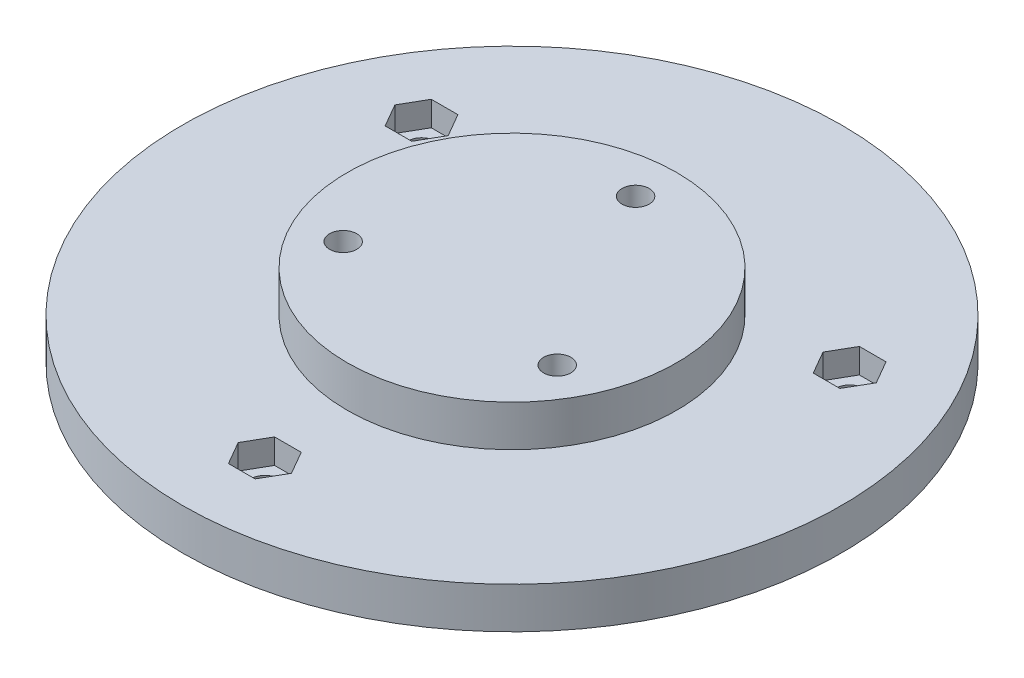
ISO-10303-21;
HEADER;
FILE_DESCRIPTION(('STEP AP214'),'2;1');
FILE_NAME('part.step','',(''),(''),'','','');
FILE_SCHEMA(('AUTOMOTIVE_DESIGN { 1 0 10303 214 1 1 1 1 }'));
ENDSEC;
DATA;
#1=APPLICATION_CONTEXT('core data for automotive mechanical design processes');
#2=APPLICATION_PROTOCOL_DEFINITION('international standard','automotive_design',2000,#1);
#3=PRODUCT_CONTEXT('',#1,'mechanical');
#4=PRODUCT('Part','Part','',(#3));
#5=PRODUCT_RELATED_PRODUCT_CATEGORY('part','',(#4));
#6=PRODUCT_DEFINITION_FORMATION('','',#4);
#7=PRODUCT_DEFINITION_CONTEXT('part definition',#1,'design');
#8=PRODUCT_DEFINITION('design','',#6,#7);
#9=PRODUCT_DEFINITION_SHAPE('','',#8);
#10=(LENGTH_UNIT() NAMED_UNIT(*) SI_UNIT(.MILLI.,.METRE.));
#11=(NAMED_UNIT(*) PLANE_ANGLE_UNIT() SI_UNIT($,.RADIAN.));
#12=(NAMED_UNIT(*) SI_UNIT($,.STERADIAN.) SOLID_ANGLE_UNIT());
#13=UNCERTAINTY_MEASURE_WITH_UNIT(LENGTH_MEASURE(1.E-05),#10,'distance_accuracy_value','');
#14=(GEOMETRIC_REPRESENTATION_CONTEXT(3) GLOBAL_UNCERTAINTY_ASSIGNED_CONTEXT((#13)) GLOBAL_UNIT_ASSIGNED_CONTEXT((#10,
#11,#12)) REPRESENTATION_CONTEXT('',''));
#15=CARTESIAN_POINT('',(0.,0.,0.));
#16=DIRECTION('',(0.,0.,1.));
#17=DIRECTION('',(1.,0.,0.));
#18=AXIS2_PLACEMENT_3D('',#15,#16,#17);
#19=CARTESIAN_POINT('',(0.,20.,-15.));
#20=DIRECTION('',(0.,-1.,0.));
#21=DIRECTION('',(0.,0.,-1.));
#22=AXIS2_PLACEMENT_3D('',#19,#20,#21);
#23=CYLINDRICAL_SURFACE('',#22,1.65);
#24=CARTESIAN_POINT('',(0.,5.,-15.));
#25=DIRECTION('',(0.,1.,0.));
#26=DIRECTION('',(0.,0.,1.));
#27=AXIS2_PLACEMENT_3D('',#24,#25,#26);
#28=CIRCLE('',#27,1.65);
#29=CARTESIAN_POINT('',(0.,5.,-13.35));
#30=VERTEX_POINT('',#29);
#31=EDGE_CURVE('E11',#30,#30,#28,.T.);
#32=ORIENTED_EDGE('',*,*,#31,.T.);
#33=EDGE_LOOP('',(#32));
#34=FACE_BOUND('',#33,.T.);
#35=CARTESIAN_POINT('',(0.,-2.,-15.));
#36=DIRECTION('',(0.,-1.,0.));
#37=DIRECTION('',(0.,0.,-1.));
#38=AXIS2_PLACEMENT_3D('',#35,#36,#37);
#39=CIRCLE('',#38,1.65);
#40=CARTESIAN_POINT('',(0.,-2.,-16.65));
#41=VERTEX_POINT('',#40);
#42=EDGE_CURVE('E24',#41,#41,#39,.T.);
#43=ORIENTED_EDGE('',*,*,#42,.T.);
#44=EDGE_LOOP('',(#43));
#45=FACE_BOUND('',#44,.T.);
#46=ADVANCED_FACE('F17',(#34,#45),#23,.F.);
#47=CARTESIAN_POINT('',(-12.9903810567666,20.,7.5));
#48=DIRECTION('',(0.,-1.,0.));
#49=DIRECTION('',(0.,0.,-1.));
#50=AXIS2_PLACEMENT_3D('',#47,#48,#49);
#51=CYLINDRICAL_SURFACE('',#50,1.65);
#52=CARTESIAN_POINT('',(-12.9903810567666,5.,7.5));
#53=DIRECTION('',(0.,1.,0.));
#54=DIRECTION('',(0.,0.,1.));
#55=AXIS2_PLACEMENT_3D('',#52,#53,#54);
#56=CIRCLE('',#55,1.65);
#57=CARTESIAN_POINT('',(-12.9903810567666,5.,9.15));
#58=VERTEX_POINT('',#57);
#59=EDGE_CURVE('E351',#58,#58,#56,.T.);
#60=ORIENTED_EDGE('',*,*,#59,.T.);
#61=EDGE_LOOP('',(#60));
#62=FACE_BOUND('',#61,.T.);
#63=CARTESIAN_POINT('',(-12.9903810567666,-2.,7.5));
#64=DIRECTION('',(0.,-1.,0.));
#65=DIRECTION('',(0.,0.,-1.));
#66=AXIS2_PLACEMENT_3D('',#63,#64,#65);
#67=CIRCLE('',#66,1.65);
#68=CARTESIAN_POINT('',(-12.9903810567666,-2.,5.85));
#69=VERTEX_POINT('',#68);
#70=EDGE_CURVE('E348',#69,#69,#67,.T.);
#71=ORIENTED_EDGE('',*,*,#70,.T.);
#72=EDGE_LOOP('',(#71));
#73=FACE_BOUND('',#72,.T.);
#74=ADVANCED_FACE('F411',(#62,#73),#51,.F.);
#75=CARTESIAN_POINT('',(12.9903810567666,20.,7.5));
#76=DIRECTION('',(0.,-1.,0.));
#77=DIRECTION('',(0.,0.,-1.));
#78=AXIS2_PLACEMENT_3D('',#75,#76,#77);
#79=CYLINDRICAL_SURFACE('',#78,1.65);
#80=CARTESIAN_POINT('',(12.9903810567666,5.,7.5));
#81=DIRECTION('',(0.,1.,0.));
#82=DIRECTION('',(0.,0.,1.));
#83=AXIS2_PLACEMENT_3D('',#80,#81,#82);
#84=CIRCLE('',#83,1.65);
#85=CARTESIAN_POINT('',(12.9903810567666,5.,9.15));
#86=VERTEX_POINT('',#85);
#87=EDGE_CURVE('E345',#86,#86,#84,.T.);
#88=ORIENTED_EDGE('',*,*,#87,.T.);
#89=EDGE_LOOP('',(#88));
#90=FACE_BOUND('',#89,.T.);
#91=CARTESIAN_POINT('',(12.9903810567666,-2.,7.5));
#92=DIRECTION('',(0.,-1.,0.));
#93=DIRECTION('',(0.,0.,-1.));
#94=AXIS2_PLACEMENT_3D('',#91,#92,#93);
#95=CIRCLE('',#94,1.65);
#96=CARTESIAN_POINT('',(12.9903810567666,-2.,5.85));
#97=VERTEX_POINT('',#96);
#98=EDGE_CURVE('E342',#97,#97,#95,.T.);
#99=ORIENTED_EDGE('',*,*,#98,.T.);
#100=EDGE_LOOP('',(#99));
#101=FACE_BOUND('',#100,.T.);
#102=ADVANCED_FACE('F417',(#90,#101),#79,.F.);
#103=CARTESIAN_POINT('',(25.9807621135331,20.,-15.));
#104=DIRECTION('',(0.,-1.,0.));
#105=DIRECTION('',(0.,0.,-1.));
#106=AXIS2_PLACEMENT_3D('',#103,#104,#105);
#107=CYLINDRICAL_SURFACE('',#106,1.65);
#108=CARTESIAN_POINT('',(25.9807621135331,-5.,-15.));
#109=DIRECTION('',(0.,-1.,0.));
#110=DIRECTION('',(0.,0.,-1.));
#111=AXIS2_PLACEMENT_3D('',#108,#109,#110);
#112=CIRCLE('',#111,1.65);
#113=CARTESIAN_POINT('',(25.9807621135331,-5.,-16.65));
#114=VERTEX_POINT('',#113);
#115=EDGE_CURVE('E339',#114,#114,#112,.T.);
#116=ORIENTED_EDGE('',*,*,#115,.T.);
#117=EDGE_LOOP('',(#116));
#118=FACE_BOUND('',#117,.T.);
#119=CARTESIAN_POINT('',(25.9807621135331,-3.,-15.));
#120=DIRECTION('',(0.,-1.,0.));
#121=DIRECTION('',(0.,0.,-1.));
#122=AXIS2_PLACEMENT_3D('',#119,#120,#121);
#123=CIRCLE('',#122,1.65);
#124=CARTESIAN_POINT('',(25.9807621135331,-3.,-16.65));
#125=VERTEX_POINT('',#124);
#126=EDGE_CURVE('E336',#125,#125,#123,.T.);
#127=ORIENTED_EDGE('',*,*,#126,.F.);
#128=EDGE_LOOP('',(#127));
#129=FACE_BOUND('',#128,.T.);
#130=ADVANCED_FACE('F702',(#118,#129),#107,.F.);
#131=CARTESIAN_POINT('',(-25.9807621135331,20.,-15.));
#132=DIRECTION('',(0.,-1.,0.));
#133=DIRECTION('',(0.,0.,-1.));
#134=AXIS2_PLACEMENT_3D('',#131,#132,#133);
#135=CYLINDRICAL_SURFACE('',#134,1.65);
#136=CARTESIAN_POINT('',(-25.9807621135331,-5.,-15.));
#137=DIRECTION('',(0.,-1.,0.));
#138=DIRECTION('',(0.,0.,-1.));
#139=AXIS2_PLACEMENT_3D('',#136,#137,#138);
#140=CIRCLE('',#139,1.65);
#141=CARTESIAN_POINT('',(-25.9807621135331,-5.,-16.65));
#142=VERTEX_POINT('',#141);
#143=EDGE_CURVE('E333',#142,#142,#140,.T.);
#144=ORIENTED_EDGE('',*,*,#143,.T.);
#145=EDGE_LOOP('',(#144));
#146=FACE_BOUND('',#145,.T.);
#147=CARTESIAN_POINT('',(-25.9807621135331,-3.,-15.));
#148=DIRECTION('',(0.,-1.,0.));
#149=DIRECTION('',(0.,0.,-1.));
#150=AXIS2_PLACEMENT_3D('',#147,#148,#149);
#151=CIRCLE('',#150,1.65);
#152=CARTESIAN_POINT('',(-25.9807621135331,-3.,-16.65));
#153=VERTEX_POINT('',#152);
#154=EDGE_CURVE('E330',#153,#153,#151,.T.);
#155=ORIENTED_EDGE('',*,*,#154,.F.);
#156=EDGE_LOOP('',(#155));
#157=FACE_BOUND('',#156,.T.);
#158=ADVANCED_FACE('F406',(#146,#157),#135,.F.);
#159=CARTESIAN_POINT('',(0.,20.,30.));
#160=DIRECTION('',(0.,-1.,0.));
#161=DIRECTION('',(0.,0.,-1.));
#162=AXIS2_PLACEMENT_3D('',#159,#160,#161);
#163=CYLINDRICAL_SURFACE('',#162,1.65);
#164=CARTESIAN_POINT('',(0.,-5.,30.));
#165=DIRECTION('',(0.,-1.,0.));
#166=DIRECTION('',(0.,0.,-1.));
#167=AXIS2_PLACEMENT_3D('',#164,#165,#166);
#168=CIRCLE('',#167,1.65);
#169=CARTESIAN_POINT('',(0.,-5.,28.35));
#170=VERTEX_POINT('',#169);
#171=EDGE_CURVE('E327',#170,#170,#168,.T.);
#172=ORIENTED_EDGE('',*,*,#171,.T.);
#173=EDGE_LOOP('',(#172));
#174=FACE_BOUND('',#173,.T.);
#175=CARTESIAN_POINT('',(0.,-3.,30.));
#176=DIRECTION('',(0.,-1.,0.));
#177=DIRECTION('',(0.,0.,-1.));
#178=AXIS2_PLACEMENT_3D('',#175,#176,#177);
#179=CIRCLE('',#178,1.65);
#180=CARTESIAN_POINT('',(0.,-3.,28.35));
#181=VERTEX_POINT('',#180);
#182=EDGE_CURVE('E324',#181,#181,#179,.T.);
#183=ORIENTED_EDGE('',*,*,#182,.F.);
#184=EDGE_LOOP('',(#183));
#185=FACE_BOUND('',#184,.T.);
#186=ADVANCED_FACE('F396',(#174,#185),#163,.F.);
#187=CARTESIAN_POINT('',(0.,-5.,0.));
#188=DIRECTION('',(0.,1.,0.));
#189=DIRECTION('',(0.,0.,1.));
#190=AXIS2_PLACEMENT_3D('',#187,#188,#189);
#191=CYLINDRICAL_SURFACE('',#190,40.);
#192=CARTESIAN_POINT('',(0.,-5.,0.));
#193=DIRECTION('',(0.,-1.,0.));
#194=DIRECTION('',(0.,0.,-1.));
#195=AXIS2_PLACEMENT_3D('',#192,#193,#194);
#196=CIRCLE('',#195,40.);
#197=CARTESIAN_POINT('',(0.,-5.,-40.));
#198=VERTEX_POINT('',#197);
#199=EDGE_CURVE('E321',#198,#198,#196,.T.);
#200=ORIENTED_EDGE('',*,*,#199,.F.);
#201=EDGE_LOOP('',(#200));
#202=FACE_BOUND('',#201,.T.);
#203=CARTESIAN_POINT('',(0.,0.,0.));
#204=DIRECTION('',(0.,-1.,0.));
#205=DIRECTION('',(0.,0.,-1.));
#206=AXIS2_PLACEMENT_3D('',#203,#204,#205);
#207=CIRCLE('',#206,40.);
#208=CARTESIAN_POINT('',(0.,0.,-40.));
#209=VERTEX_POINT('',#208);
#210=EDGE_CURVE('E318',#209,#209,#207,.T.);
#211=ORIENTED_EDGE('',*,*,#210,.T.);
#212=EDGE_LOOP('',(#211));
#213=FACE_BOUND('',#212,.T.);
#214=ADVANCED_FACE('F394',(#202,#213),#191,.T.);
#215=CARTESIAN_POINT('',(0.,-5.,0.));
#216=DIRECTION('',(0.,-1.,0.));
#217=DIRECTION('',(1.,0.,0.));
#218=AXIS2_PLACEMENT_3D('',#215,#216,#217);
#219=PLANE('',#218);
#220=CARTESIAN_POINT('',(-12.9903810567666,-5.,7.5));
#221=DIRECTION('',(0.,-1.,0.));
#222=DIRECTION('',(0.,0.,-1.));
#223=AXIS2_PLACEMENT_3D('',#220,#221,#222);
#224=CIRCLE('',#223,2.85);
#225=CARTESIAN_POINT('',(-12.9903810567666,-5.,4.65));
#226=VERTEX_POINT('',#225);
#227=EDGE_CURVE('E315',#226,#226,#224,.T.);
#228=ORIENTED_EDGE('',*,*,#227,.F.);
#229=EDGE_LOOP('',(#228));
#230=FACE_BOUND('',#229,.T.);
#231=CARTESIAN_POINT('',(12.9903810567666,-5.,7.5));
#232=DIRECTION('',(0.,-1.,0.));
#233=DIRECTION('',(0.,0.,-1.));
#234=AXIS2_PLACEMENT_3D('',#231,#232,#233);
#235=CIRCLE('',#234,2.85);
#236=CARTESIAN_POINT('',(12.9903810567666,-5.,4.65));
#237=VERTEX_POINT('',#236);
#238=EDGE_CURVE('E312',#237,#237,#235,.T.);
#239=ORIENTED_EDGE('',*,*,#238,.F.);
#240=EDGE_LOOP('',(#239));
#241=FACE_BOUND('',#240,.T.);
#242=CARTESIAN_POINT('',(0.,-5.,-15.));
#243=DIRECTION('',(0.,-1.,0.));
#244=DIRECTION('',(0.,0.,-1.));
#245=AXIS2_PLACEMENT_3D('',#242,#243,#244);
#246=CIRCLE('',#245,2.85);
#247=CARTESIAN_POINT('',(0.,-5.,-17.85));
#248=VERTEX_POINT('',#247);
#249=EDGE_CURVE('E309',#248,#248,#246,.T.);
#250=ORIENTED_EDGE('',*,*,#249,.F.);
#251=EDGE_LOOP('',(#250));
#252=FACE_BOUND('',#251,.T.);
#253=ORIENTED_EDGE('',*,*,#171,.F.);
#254=EDGE_LOOP('',(#253));
#255=FACE_BOUND('',#254,.T.);
#256=ORIENTED_EDGE('',*,*,#143,.F.);
#257=EDGE_LOOP('',(#256));
#258=FACE_BOUND('',#257,.T.);
#259=ORIENTED_EDGE('',*,*,#115,.F.);
#260=EDGE_LOOP('',(#259));
#261=FACE_BOUND('',#260,.T.);
#262=ORIENTED_EDGE('',*,*,#199,.T.);
#263=EDGE_LOOP('',(#262));
#264=FACE_BOUND('',#263,.T.);
#265=ADVANCED_FACE('F387',(#230,#241,#252,#255,#258,#261,#264),#219,.T.);
#266=CARTESIAN_POINT('',(0.,0.,0.));
#267=DIRECTION('',(0.,-1.,0.));
#268=DIRECTION('',(1.,0.,0.));
#269=AXIS2_PLACEMENT_3D('',#266,#267,#268);
#270=PLANE('',#269);
#271=CARTESIAN_POINT('',(0.,0.,0.));
#272=DIRECTION('',(0.,1.,0.));
#273=DIRECTION('',(0.,0.,1.));
#274=AXIS2_PLACEMENT_3D('',#271,#272,#273);
#275=CIRCLE('',#274,20.);
#276=CARTESIAN_POINT('',(0.,0.,20.));
#277=VERTEX_POINT('',#276);
#278=EDGE_CURVE('E306',#277,#277,#275,.T.);
#279=ORIENTED_EDGE('',*,*,#278,.F.);
#280=EDGE_LOOP('',(#279));
#281=FACE_BOUND('',#280,.T.);
#282=DIRECTION('',(1.,0.,0.));
#283=VECTOR('',#282,1.);
#284=CARTESIAN_POINT('',(0.,0.,32.8));
#285=LINE('',#284,#283);
#286=CARTESIAN_POINT('',(-1.61658075373096,0.,32.8));
#287=VERTEX_POINT('',#286);
#288=CARTESIAN_POINT('',(1.61658075373096,0.,32.8));
#289=VERTEX_POINT('',#288);
#290=EDGE_CURVE('E31',#287,#289,#285,.T.);
#291=ORIENTED_EDGE('',*,*,#290,.F.);
#292=DIRECTION('',(0.5,0.,0.866025403784439));
#293=VECTOR('',#292,1.);
#294=CARTESIAN_POINT('',(-2.42487113059643,0.,31.4));
#295=LINE('',#294,#293);
#296=CARTESIAN_POINT('',(-3.2331615074619,0.,30.));
#297=VERTEX_POINT('',#296);
#298=EDGE_CURVE('E35',#297,#287,#295,.T.);
#299=ORIENTED_EDGE('',*,*,#298,.F.);
#300=DIRECTION('',(-0.500000000000001,0.,0.866025403784438));
#301=VECTOR('',#300,1.);
#302=CARTESIAN_POINT('',(-2.42487113059643,0.,28.6));
#303=LINE('',#302,#301);
#304=CARTESIAN_POINT('',(-1.61658075373095,0.,27.2));
#305=VERTEX_POINT('',#304);
#306=EDGE_CURVE('E301',#305,#297,#303,.T.);
#307=ORIENTED_EDGE('',*,*,#306,.F.);
#308=DIRECTION('',(-1.,0.,0.));
#309=VECTOR('',#308,1.);
#310=CARTESIAN_POINT('',(0.,0.,27.2));
#311=LINE('',#310,#309);
#312=CARTESIAN_POINT('',(1.61658075373096,0.,27.2));
#313=VERTEX_POINT('',#312);
#314=EDGE_CURVE('E298',#313,#305,#311,.T.);
#315=ORIENTED_EDGE('',*,*,#314,.F.);
#316=DIRECTION('',(-0.5,0.,-0.866025403784439));
#317=VECTOR('',#316,1.);
#318=CARTESIAN_POINT('',(2.42487113059643,0.,28.6));
#319=LINE('',#318,#317);
#320=CARTESIAN_POINT('',(3.23316150746191,0.,30.));
#321=VERTEX_POINT('',#320);
#322=EDGE_CURVE('E295',#321,#313,#319,.T.);
#323=ORIENTED_EDGE('',*,*,#322,.F.);
#324=DIRECTION('',(0.500000000000001,0.,-0.866025403784438));
#325=VECTOR('',#324,1.);
#326=CARTESIAN_POINT('',(2.42487113059643,0.,31.4));
#327=LINE('',#326,#325);
#328=EDGE_CURVE('E292',#289,#321,#327,.T.);
#329=ORIENTED_EDGE('',*,*,#328,.F.);
#330=EDGE_LOOP('',(#291,#299,#307,#315,#323,#329));
#331=FACE_BOUND('',#330,.T.);
#332=DIRECTION('',(-0.499999999999999,0.,-0.866025403784439));
#333=VECTOR('',#332,1.);
#334=CARTESIAN_POINT('',(-23.5558909829367,0.,-16.4));
#335=LINE('',#334,#333);
#336=CARTESIAN_POINT('',(-22.7476006060712,0.,-15.));
#337=VERTEX_POINT('',#336);
#338=CARTESIAN_POINT('',(-24.3641813598022,0.,-17.8));
#339=VERTEX_POINT('',#338);
#340=EDGE_CURVE('E289',#337,#339,#335,.T.);
#341=ORIENTED_EDGE('',*,*,#340,.F.);
#342=DIRECTION('',(0.5,0.,-0.866025403784439));
#343=VECTOR('',#342,1.);
#344=CARTESIAN_POINT('',(-23.5558909829367,0.,-13.6));
#345=LINE('',#344,#343);
#346=CARTESIAN_POINT('',(-24.3641813598022,0.,-12.2));
#347=VERTEX_POINT('',#346);
#348=EDGE_CURVE('E286',#347,#337,#345,.T.);
#349=ORIENTED_EDGE('',*,*,#348,.F.);
#350=DIRECTION('',(1.,0.,0.));
#351=VECTOR('',#350,1.);
#352=CARTESIAN_POINT('',(-25.9807621135331,0.,-12.2));
#353=LINE('',#352,#351);
#354=CARTESIAN_POINT('',(-27.5973428672641,0.,-12.2));
#355=VERTEX_POINT('',#354);
#356=EDGE_CURVE('E283',#355,#347,#353,.T.);
#357=ORIENTED_EDGE('',*,*,#356,.F.);
#358=DIRECTION('',(0.5,0.,0.866025403784439));
#359=VECTOR('',#358,1.);
#360=CARTESIAN_POINT('',(-28.4056332441296,0.,-13.6));
#361=LINE('',#360,#359);
#362=CARTESIAN_POINT('',(-29.2139236209951,0.,-15.));
#363=VERTEX_POINT('',#362);
#364=EDGE_CURVE('E280',#363,#355,#361,.T.);
#365=ORIENTED_EDGE('',*,*,#364,.F.);
#366=DIRECTION('',(-0.5,0.,0.866025403784439));
#367=VECTOR('',#366,1.);
#368=CARTESIAN_POINT('',(-28.4056332441296,0.,-16.4));
#369=LINE('',#368,#367);
#370=CARTESIAN_POINT('',(-27.5973428672641,0.,-17.8));
#371=VERTEX_POINT('',#370);
#372=EDGE_CURVE('E277',#371,#363,#369,.T.);
#373=ORIENTED_EDGE('',*,*,#372,.F.);
#374=DIRECTION('',(-1.,0.,0.));
#375=VECTOR('',#374,1.);
#376=CARTESIAN_POINT('',(-25.9807621135331,0.,-17.8));
#377=LINE('',#376,#375);
#378=EDGE_CURVE('E274',#339,#371,#377,.T.);
#379=ORIENTED_EDGE('',*,*,#378,.F.);
#380=EDGE_LOOP('',(#341,#349,#357,#365,#373,#379));
#381=FACE_BOUND('',#380,.T.);
#382=DIRECTION('',(1.,0.,0.));
#383=VECTOR('',#382,1.);
#384=CARTESIAN_POINT('',(25.9807621135331,0.,-12.2));
#385=LINE('',#384,#383);
#386=CARTESIAN_POINT('',(24.3641813598022,0.,-12.2));
#387=VERTEX_POINT('',#386);
#388=CARTESIAN_POINT('',(27.5973428672641,0.,-12.2));
#389=VERTEX_POINT('',#388);
#390=EDGE_CURVE('E271',#387,#389,#385,.T.);
#391=ORIENTED_EDGE('',*,*,#390,.F.);
#392=DIRECTION('',(0.5,0.,0.866025403784439));
#393=VECTOR('',#392,1.);
#394=CARTESIAN_POINT('',(23.5558909829367,0.,-13.6));
#395=LINE('',#394,#393);
#396=CARTESIAN_POINT('',(22.7476006060712,0.,-15.));
#397=VERTEX_POINT('',#396);
#398=EDGE_CURVE('E268',#397,#387,#395,.T.);
#399=ORIENTED_EDGE('',*,*,#398,.F.);
#400=DIRECTION('',(-0.5,0.,0.866025403784439));
#401=VECTOR('',#400,1.);
#402=CARTESIAN_POINT('',(23.5558909829367,0.,-16.4));
#403=LINE('',#402,#401);
#404=CARTESIAN_POINT('',(24.3641813598022,0.,-17.8));
#405=VERTEX_POINT('',#404);
#406=EDGE_CURVE('E266',#405,#397,#403,.T.);
#407=ORIENTED_EDGE('',*,*,#406,.F.);
#408=DIRECTION('',(-1.,0.,0.));
#409=VECTOR('',#408,1.);
#410=CARTESIAN_POINT('',(25.9807621135331,0.,-17.8));
#411=LINE('',#410,#409);
#412=CARTESIAN_POINT('',(27.5973428672641,0.,-17.8));
#413=VERTEX_POINT('',#412);
#414=EDGE_CURVE('E147',#413,#405,#411,.T.);
#415=ORIENTED_EDGE('',*,*,#414,.F.);
#416=DIRECTION('',(-0.5,0.,-0.866025403784439));
#417=VECTOR('',#416,1.);
#418=CARTESIAN_POINT('',(28.4056332441296,0.,-16.4));
#419=LINE('',#418,#417);
#420=CARTESIAN_POINT('',(29.2139236209951,0.,-15.));
#421=VERTEX_POINT('',#420);
#422=EDGE_CURVE('E262',#421,#413,#419,.T.);
#423=ORIENTED_EDGE('',*,*,#422,.F.);
#424=DIRECTION('',(0.5,0.,-0.866025403784438));
#425=VECTOR('',#424,1.);
#426=CARTESIAN_POINT('',(28.4056332441296,0.,-13.6));
#427=LINE('',#426,#425);
#428=EDGE_CURVE('E259',#389,#421,#427,.T.);
#429=ORIENTED_EDGE('',*,*,#428,.F.);
#430=EDGE_LOOP('',(#391,#399,#407,#415,#423,#429));
#431=FACE_BOUND('',#430,.T.);
#432=ORIENTED_EDGE('',*,*,#210,.F.);
#433=EDGE_LOOP('',(#432));
#434=FACE_BOUND('',#433,.T.);
#435=ADVANCED_FACE('F384',(#281,#331,#381,#431,#434),#270,.F.);
#436=CARTESIAN_POINT('',(-2.42487113059643,-3.,31.4));
#437=DIRECTION('',(-0.866025403784438,0.,0.5));
#438=DIRECTION('',(0.5,0.,0.866025403784439));
#439=AXIS2_PLACEMENT_3D('',#436,#437,#438);
#440=PLANE('',#439);
#441=ORIENTED_EDGE('',*,*,#298,.T.);
#442=DIRECTION('',(0.,1.,0.));
#443=VECTOR('',#442,1.);
#444=CARTESIAN_POINT('',(-1.61658075373096,-3.,32.8));
#445=LINE('',#444,#443);
#446=CARTESIAN_POINT('',(-1.61658075373096,-3.,32.8));
#447=VERTEX_POINT('',#446);
#448=EDGE_CURVE('E256',#447,#287,#445,.T.);
#449=ORIENTED_EDGE('',*,*,#448,.F.);
#450=DIRECTION('',(0.5,0.,0.866025403784439));
#451=VECTOR('',#450,1.);
#452=CARTESIAN_POINT('',(-2.42487113059643,-3.,31.4));
#453=LINE('',#452,#451);
#454=CARTESIAN_POINT('',(-3.2331615074619,-3.,30.));
#455=VERTEX_POINT('',#454);
#456=EDGE_CURVE('E253',#455,#447,#453,.T.);
#457=ORIENTED_EDGE('',*,*,#456,.F.);
#458=DIRECTION('',(0.,1.,0.));
#459=VECTOR('',#458,1.);
#460=CARTESIAN_POINT('',(-3.2331615074619,-3.,30.));
#461=LINE('',#460,#459);
#462=EDGE_CURVE('E251',#455,#297,#461,.T.);
#463=ORIENTED_EDGE('',*,*,#462,.T.);
#464=EDGE_LOOP('',(#441,#449,#457,#463));
#465=FACE_BOUND('',#464,.T.);
#466=ADVANCED_FACE('F386',(#465),#440,.F.);
#467=CARTESIAN_POINT('',(0.,-3.,32.8));
#468=DIRECTION('',(0.,0.,1.));
#469=DIRECTION('',(1.,0.,0.));
#470=AXIS2_PLACEMENT_3D('',#467,#468,#469);
#471=PLANE('',#470);
#472=ORIENTED_EDGE('',*,*,#290,.T.);
#473=DIRECTION('',(0.,1.,0.));
#474=VECTOR('',#473,1.);
#475=CARTESIAN_POINT('',(1.61658075373096,-3.,32.8));
#476=LINE('',#475,#474);
#477=CARTESIAN_POINT('',(1.61658075373096,-3.,32.8));
#478=VERTEX_POINT('',#477);
#479=EDGE_CURVE('E248',#478,#289,#476,.T.);
#480=ORIENTED_EDGE('',*,*,#479,.F.);
#481=DIRECTION('',(1.,0.,0.));
#482=VECTOR('',#481,1.);
#483=CARTESIAN_POINT('',(0.,-3.,32.8));
#484=LINE('',#483,#482);
#485=EDGE_CURVE('E245',#447,#478,#484,.T.);
#486=ORIENTED_EDGE('',*,*,#485,.F.);
#487=ORIENTED_EDGE('',*,*,#448,.T.);
#488=EDGE_LOOP('',(#472,#480,#486,#487));
#489=FACE_BOUND('',#488,.T.);
#490=ADVANCED_FACE('F505',(#489),#471,.F.);
#491=CARTESIAN_POINT('',(2.42487113059643,-3.,31.4));
#492=DIRECTION('',(0.866025403784437,0.,0.5));
#493=DIRECTION('',(0.5,0.,-0.866025403784438));
#494=AXIS2_PLACEMENT_3D('',#491,#492,#493);
#495=PLANE('',#494);
#496=ORIENTED_EDGE('',*,*,#328,.T.);
#497=DIRECTION('',(0.,1.,0.));
#498=VECTOR('',#497,1.);
#499=CARTESIAN_POINT('',(3.23316150746191,-3.,30.));
#500=LINE('',#499,#498);
#501=CARTESIAN_POINT('',(3.23316150746191,-3.,30.));
#502=VERTEX_POINT('',#501);
#503=EDGE_CURVE('E242',#502,#321,#500,.T.);
#504=ORIENTED_EDGE('',*,*,#503,.F.);
#505=DIRECTION('',(0.500000000000001,0.,-0.866025403784438));
#506=VECTOR('',#505,1.);
#507=CARTESIAN_POINT('',(2.42487113059643,-3.,31.4));
#508=LINE('',#507,#506);
#509=EDGE_CURVE('E239',#478,#502,#508,.T.);
#510=ORIENTED_EDGE('',*,*,#509,.F.);
#511=ORIENTED_EDGE('',*,*,#479,.T.);
#512=EDGE_LOOP('',(#496,#504,#510,#511));
#513=FACE_BOUND('',#512,.T.);
#514=ADVANCED_FACE('F501',(#513),#495,.F.);
#515=CARTESIAN_POINT('',(2.42487113059643,-3.,28.6));
#516=DIRECTION('',(0.866025403784439,0.,-0.5));
#517=DIRECTION('',(-0.5,0.,-0.866025403784439));
#518=AXIS2_PLACEMENT_3D('',#515,#516,#517);
#519=PLANE('',#518);
#520=ORIENTED_EDGE('',*,*,#322,.T.);
#521=DIRECTION('',(0.,1.,0.));
#522=VECTOR('',#521,1.);
#523=CARTESIAN_POINT('',(1.61658075373096,-3.,27.2));
#524=LINE('',#523,#522);
#525=CARTESIAN_POINT('',(1.61658075373096,-3.,27.2));
#526=VERTEX_POINT('',#525);
#527=EDGE_CURVE('E236',#526,#313,#524,.T.);
#528=ORIENTED_EDGE('',*,*,#527,.F.);
#529=DIRECTION('',(-0.5,0.,-0.866025403784439));
#530=VECTOR('',#529,1.);
#531=CARTESIAN_POINT('',(2.42487113059643,-3.,28.6));
#532=LINE('',#531,#530);
#533=EDGE_CURVE('E233',#502,#526,#532,.T.);
#534=ORIENTED_EDGE('',*,*,#533,.F.);
#535=ORIENTED_EDGE('',*,*,#503,.T.);
#536=EDGE_LOOP('',(#520,#528,#534,#535));
#537=FACE_BOUND('',#536,.T.);
#538=ADVANCED_FACE('F497',(#537),#519,.F.);
#539=CARTESIAN_POINT('',(0.,-3.,27.2));
#540=DIRECTION('',(0.,0.,-1.));
#541=DIRECTION('',(-1.,0.,0.));
#542=AXIS2_PLACEMENT_3D('',#539,#540,#541);
#543=PLANE('',#542);
#544=ORIENTED_EDGE('',*,*,#314,.T.);
#545=DIRECTION('',(0.,1.,0.));
#546=VECTOR('',#545,1.);
#547=CARTESIAN_POINT('',(-1.61658075373095,-3.,27.2));
#548=LINE('',#547,#546);
#549=CARTESIAN_POINT('',(-1.61658075373095,-3.,27.2));
#550=VERTEX_POINT('',#549);
#551=EDGE_CURVE('E230',#550,#305,#548,.T.);
#552=ORIENTED_EDGE('',*,*,#551,.F.);
#553=DIRECTION('',(-1.,0.,0.));
#554=VECTOR('',#553,1.);
#555=CARTESIAN_POINT('',(0.,-3.,27.2));
#556=LINE('',#555,#554);
#557=EDGE_CURVE('E227',#526,#550,#556,.T.);
#558=ORIENTED_EDGE('',*,*,#557,.F.);
#559=ORIENTED_EDGE('',*,*,#527,.T.);
#560=EDGE_LOOP('',(#544,#552,#558,#559));
#561=FACE_BOUND('',#560,.T.);
#562=ADVANCED_FACE('F493',(#561),#543,.F.);
#563=CARTESIAN_POINT('',(-2.42487113059643,-3.,28.6));
#564=DIRECTION('',(-0.866025403784437,0.,-0.5));
#565=DIRECTION('',(-0.5,0.,0.866025403784437));
#566=AXIS2_PLACEMENT_3D('',#563,#564,#565);
#567=PLANE('',#566);
#568=ORIENTED_EDGE('',*,*,#306,.T.);
#569=ORIENTED_EDGE('',*,*,#462,.F.);
#570=DIRECTION('',(-0.500000000000001,0.,0.866025403784438));
#571=VECTOR('',#570,1.);
#572=CARTESIAN_POINT('',(-2.42487113059643,-3.,28.6));
#573=LINE('',#572,#571);
#574=EDGE_CURVE('E224',#550,#455,#573,.T.);
#575=ORIENTED_EDGE('',*,*,#574,.F.);
#576=ORIENTED_EDGE('',*,*,#551,.T.);
#577=EDGE_LOOP('',(#568,#569,#575,#576));
#578=FACE_BOUND('',#577,.T.);
#579=ADVANCED_FACE('F489',(#578),#567,.F.);
#580=CARTESIAN_POINT('',(0.,-3.,0.));
#581=DIRECTION('',(0.,1.,0.));
#582=DIRECTION('',(-1.,0.,0.));
#583=AXIS2_PLACEMENT_3D('',#580,#581,#582);
#584=PLANE('',#583);
#585=ORIENTED_EDGE('',*,*,#182,.T.);
#586=EDGE_LOOP('',(#585));
#587=FACE_BOUND('',#586,.T.);
#588=ORIENTED_EDGE('',*,*,#456,.T.);
#589=ORIENTED_EDGE('',*,*,#485,.T.);
#590=ORIENTED_EDGE('',*,*,#509,.T.);
#591=ORIENTED_EDGE('',*,*,#533,.T.);
#592=ORIENTED_EDGE('',*,*,#557,.T.);
#593=ORIENTED_EDGE('',*,*,#574,.T.);
#594=EDGE_LOOP('',(#588,#589,#590,#591,#592,#593));
#595=FACE_BOUND('',#594,.T.);
#596=ADVANCED_FACE('F485',(#587,#595),#584,.T.);
#597=CARTESIAN_POINT('',(-23.5558909829367,-3.,-13.6));
#598=DIRECTION('',(0.866025403784438,0.,0.5));
#599=DIRECTION('',(0.5,0.,-0.866025403784439));
#600=AXIS2_PLACEMENT_3D('',#597,#598,#599);
#601=PLANE('',#600);
#602=ORIENTED_EDGE('',*,*,#348,.T.);
#603=DIRECTION('',(0.,1.,0.));
#604=VECTOR('',#603,1.);
#605=CARTESIAN_POINT('',(-22.7476006060712,-3.,-15.));
#606=LINE('',#605,#604);
#607=CARTESIAN_POINT('',(-22.7476006060712,-3.,-15.));
#608=VERTEX_POINT('',#607);
#609=EDGE_CURVE('E221',#608,#337,#606,.T.);
#610=ORIENTED_EDGE('',*,*,#609,.F.);
#611=DIRECTION('',(0.5,0.,-0.866025403784439));
#612=VECTOR('',#611,1.);
#613=CARTESIAN_POINT('',(-23.5558909829367,-3.,-13.6));
#614=LINE('',#613,#612);
#615=CARTESIAN_POINT('',(-24.3641813598022,-3.,-12.2));
#616=VERTEX_POINT('',#615);
#617=EDGE_CURVE('E218',#616,#608,#614,.T.);
#618=ORIENTED_EDGE('',*,*,#617,.F.);
#619=DIRECTION('',(0.,1.,0.));
#620=VECTOR('',#619,1.);
#621=CARTESIAN_POINT('',(-24.3641813598022,-3.,-12.2));
#622=LINE('',#621,#620);
#623=EDGE_CURVE('E215',#616,#347,#622,.T.);
#624=ORIENTED_EDGE('',*,*,#623,.T.);
#625=EDGE_LOOP('',(#602,#610,#618,#624));
#626=FACE_BOUND('',#625,.T.);
#627=ADVANCED_FACE('F481',(#626),#601,.F.);
#628=CARTESIAN_POINT('',(-23.5558909829367,-3.,-16.4));
#629=DIRECTION('',(0.86602540378444,0.,-0.5));
#630=DIRECTION('',(-0.5,0.,-0.866025403784441));
#631=AXIS2_PLACEMENT_3D('',#628,#629,#630);
#632=PLANE('',#631);
#633=ORIENTED_EDGE('',*,*,#340,.T.);
#634=DIRECTION('',(0.,1.,0.));
#635=VECTOR('',#634,1.);
#636=CARTESIAN_POINT('',(-24.3641813598022,-3.,-17.8));
#637=LINE('',#636,#635);
#638=CARTESIAN_POINT('',(-24.3641813598022,-3.,-17.8));
#639=VERTEX_POINT('',#638);
#640=EDGE_CURVE('E212',#639,#339,#637,.T.);
#641=ORIENTED_EDGE('',*,*,#640,.F.);
#642=DIRECTION('',(-0.499999999999999,0.,-0.866025403784439));
#643=VECTOR('',#642,1.);
#644=CARTESIAN_POINT('',(-23.5558909829367,-3.,-16.4));
#645=LINE('',#644,#643);
#646=EDGE_CURVE('E209',#608,#639,#645,.T.);
#647=ORIENTED_EDGE('',*,*,#646,.F.);
#648=ORIENTED_EDGE('',*,*,#609,.T.);
#649=EDGE_LOOP('',(#633,#641,#647,#648));
#650=FACE_BOUND('',#649,.T.);
#651=ADVANCED_FACE('F477',(#650),#632,.F.);
#652=CARTESIAN_POINT('',(-25.9807621135331,-3.,-17.8));
#653=DIRECTION('',(0.,0.,-1.));
#654=DIRECTION('',(-1.,0.,0.));
#655=AXIS2_PLACEMENT_3D('',#652,#653,#654);
#656=PLANE('',#655);
#657=ORIENTED_EDGE('',*,*,#378,.T.);
#658=DIRECTION('',(0.,1.,0.));
#659=VECTOR('',#658,1.);
#660=CARTESIAN_POINT('',(-27.5973428672641,-3.,-17.8));
#661=LINE('',#660,#659);
#662=CARTESIAN_POINT('',(-27.5973428672641,-3.,-17.8));
#663=VERTEX_POINT('',#662);
#664=EDGE_CURVE('E206',#663,#371,#661,.T.);
#665=ORIENTED_EDGE('',*,*,#664,.F.);
#666=DIRECTION('',(-1.,0.,0.));
#667=VECTOR('',#666,1.);
#668=CARTESIAN_POINT('',(-25.9807621135331,-3.,-17.8));
#669=LINE('',#668,#667);
#670=EDGE_CURVE('E203',#639,#663,#669,.T.);
#671=ORIENTED_EDGE('',*,*,#670,.F.);
#672=ORIENTED_EDGE('',*,*,#640,.T.);
#673=EDGE_LOOP('',(#657,#665,#671,#672));
#674=FACE_BOUND('',#673,.T.);
#675=ADVANCED_FACE('F473',(#674),#656,.F.);
#676=CARTESIAN_POINT('',(-28.4056332441296,-3.,-16.4));
#677=DIRECTION('',(-0.866025403784438,0.,-0.5));
#678=DIRECTION('',(-0.5,0.,0.866025403784439));
#679=AXIS2_PLACEMENT_3D('',#676,#677,#678);
#680=PLANE('',#679);
#681=ORIENTED_EDGE('',*,*,#372,.T.);
#682=DIRECTION('',(0.,1.,0.));
#683=VECTOR('',#682,1.);
#684=CARTESIAN_POINT('',(-29.2139236209951,-3.,-15.));
#685=LINE('',#684,#683);
#686=CARTESIAN_POINT('',(-29.2139236209951,-3.,-15.));
#687=VERTEX_POINT('',#686);
#688=EDGE_CURVE('E200',#687,#363,#685,.T.);
#689=ORIENTED_EDGE('',*,*,#688,.F.);
#690=DIRECTION('',(-0.5,0.,0.866025403784439));
#691=VECTOR('',#690,1.);
#692=CARTESIAN_POINT('',(-28.4056332441296,-3.,-16.4));
#693=LINE('',#692,#691);
#694=EDGE_CURVE('E197',#663,#687,#693,.T.);
#695=ORIENTED_EDGE('',*,*,#694,.F.);
#696=ORIENTED_EDGE('',*,*,#664,.T.);
#697=EDGE_LOOP('',(#681,#689,#695,#696));
#698=FACE_BOUND('',#697,.T.);
#699=ADVANCED_FACE('F469',(#698),#680,.F.);
#700=CARTESIAN_POINT('',(-28.4056332441296,-3.,-13.6));
#701=DIRECTION('',(-0.866025403784439,0.,0.5));
#702=DIRECTION('',(0.5,0.,0.866025403784439));
#703=AXIS2_PLACEMENT_3D('',#700,#701,#702);
#704=PLANE('',#703);
#705=ORIENTED_EDGE('',*,*,#364,.T.);
#706=DIRECTION('',(0.,1.,0.));
#707=VECTOR('',#706,1.);
#708=CARTESIAN_POINT('',(-27.5973428672641,-3.,-12.2));
#709=LINE('',#708,#707);
#710=CARTESIAN_POINT('',(-27.5973428672641,-3.,-12.2));
#711=VERTEX_POINT('',#710);
#712=EDGE_CURVE('E194',#711,#355,#709,.T.);
#713=ORIENTED_EDGE('',*,*,#712,.F.);
#714=DIRECTION('',(0.5,0.,0.866025403784439));
#715=VECTOR('',#714,1.);
#716=CARTESIAN_POINT('',(-28.4056332441296,-3.,-13.6));
#717=LINE('',#716,#715);
#718=EDGE_CURVE('E191',#687,#711,#717,.T.);
#719=ORIENTED_EDGE('',*,*,#718,.F.);
#720=ORIENTED_EDGE('',*,*,#688,.T.);
#721=EDGE_LOOP('',(#705,#713,#719,#720));
#722=FACE_BOUND('',#721,.T.);
#723=ADVANCED_FACE('F465',(#722),#704,.F.);
#724=CARTESIAN_POINT('',(-25.9807621135331,-3.,-12.2));
#725=DIRECTION('',(0.,0.,1.));
#726=DIRECTION('',(1.,0.,0.));
#727=AXIS2_PLACEMENT_3D('',#724,#725,#726);
#728=PLANE('',#727);
#729=ORIENTED_EDGE('',*,*,#356,.T.);
#730=ORIENTED_EDGE('',*,*,#623,.F.);
#731=DIRECTION('',(1.,0.,0.));
#732=VECTOR('',#731,1.);
#733=CARTESIAN_POINT('',(-25.9807621135331,-3.,-12.2));
#734=LINE('',#733,#732);
#735=EDGE_CURVE('E188',#711,#616,#734,.T.);
#736=ORIENTED_EDGE('',*,*,#735,.F.);
#737=ORIENTED_EDGE('',*,*,#712,.T.);
#738=EDGE_LOOP('',(#729,#730,#736,#737));
#739=FACE_BOUND('',#738,.T.);
#740=ADVANCED_FACE('F461',(#739),#728,.F.);
#741=CARTESIAN_POINT('',(0.,-3.,0.));
#742=DIRECTION('',(0.,1.,0.));
#743=DIRECTION('',(-1.,0.,0.));
#744=AXIS2_PLACEMENT_3D('',#741,#742,#743);
#745=PLANE('',#744);
#746=ORIENTED_EDGE('',*,*,#154,.T.);
#747=EDGE_LOOP('',(#746));
#748=FACE_BOUND('',#747,.T.);
#749=ORIENTED_EDGE('',*,*,#617,.T.);
#750=ORIENTED_EDGE('',*,*,#646,.T.);
#751=ORIENTED_EDGE('',*,*,#670,.T.);
#752=ORIENTED_EDGE('',*,*,#694,.T.);
#753=ORIENTED_EDGE('',*,*,#718,.T.);
#754=ORIENTED_EDGE('',*,*,#735,.T.);
#755=EDGE_LOOP('',(#749,#750,#751,#752,#753,#754));
#756=FACE_BOUND('',#755,.T.);
#757=ADVANCED_FACE('F457',(#748,#756),#745,.T.);
#758=CARTESIAN_POINT('',(23.5558909829367,-3.,-13.6));
#759=DIRECTION('',(-0.866025403784438,0.,0.5));
#760=DIRECTION('',(0.5,0.,0.866025403784439));
#761=AXIS2_PLACEMENT_3D('',#758,#759,#760);
#762=PLANE('',#761);
#763=ORIENTED_EDGE('',*,*,#398,.T.);
#764=DIRECTION('',(0.,1.,0.));
#765=VECTOR('',#764,1.);
#766=CARTESIAN_POINT('',(24.3641813598022,-3.,-12.2));
#767=LINE('',#766,#765);
#768=CARTESIAN_POINT('',(24.3641813598022,-3.,-12.2));
#769=VERTEX_POINT('',#768);
#770=EDGE_CURVE('E185',#769,#387,#767,.T.);
#771=ORIENTED_EDGE('',*,*,#770,.F.);
#772=DIRECTION('',(0.5,0.,0.866025403784439));
#773=VECTOR('',#772,1.);
#774=CARTESIAN_POINT('',(23.5558909829367,-3.,-13.6));
#775=LINE('',#774,#773);
#776=CARTESIAN_POINT('',(22.7476006060712,-3.,-15.));
#777=VERTEX_POINT('',#776);
#778=EDGE_CURVE('E183',#777,#769,#775,.T.);
#779=ORIENTED_EDGE('',*,*,#778,.F.);
#780=DIRECTION('',(0.,1.,0.));
#781=VECTOR('',#780,1.);
#782=CARTESIAN_POINT('',(22.7476006060712,-3.,-15.));
#783=LINE('',#782,#781);
#784=EDGE_CURVE('E157',#777,#397,#783,.T.);
#785=ORIENTED_EDGE('',*,*,#784,.T.);
#786=EDGE_LOOP('',(#763,#771,#779,#785));
#787=FACE_BOUND('',#786,.T.);
#788=ADVANCED_FACE('F453',(#787),#762,.F.);
#789=CARTESIAN_POINT('',(25.9807621135331,-3.,-12.2));
#790=DIRECTION('',(0.,0.,1.));
#791=DIRECTION('',(1.,0.,0.));
#792=AXIS2_PLACEMENT_3D('',#789,#790,#791);
#793=PLANE('',#792);
#794=ORIENTED_EDGE('',*,*,#390,.T.);
#795=DIRECTION('',(0.,1.,0.));
#796=VECTOR('',#795,1.);
#797=CARTESIAN_POINT('',(27.5973428672641,-3.,-12.2));
#798=LINE('',#797,#796);
#799=CARTESIAN_POINT('',(27.5973428672641,-3.,-12.2));
#800=VERTEX_POINT('',#799);
#801=EDGE_CURVE('E179',#800,#389,#798,.T.);
#802=ORIENTED_EDGE('',*,*,#801,.F.);
#803=DIRECTION('',(1.,0.,0.));
#804=VECTOR('',#803,1.);
#805=CARTESIAN_POINT('',(25.9807621135331,-3.,-12.2));
#806=LINE('',#805,#804);
#807=EDGE_CURVE('E176',#769,#800,#806,.T.);
#808=ORIENTED_EDGE('',*,*,#807,.F.);
#809=ORIENTED_EDGE('',*,*,#770,.T.);
#810=EDGE_LOOP('',(#794,#802,#808,#809));
#811=FACE_BOUND('',#810,.T.);
#812=ADVANCED_FACE('F449',(#811),#793,.F.);
#813=CARTESIAN_POINT('',(28.4056332441296,-3.,-13.6));
#814=DIRECTION('',(0.866025403784438,0.,0.5));
#815=DIRECTION('',(0.5,0.,-0.866025403784438));
#816=AXIS2_PLACEMENT_3D('',#813,#814,#815);
#817=PLANE('',#816);
#818=ORIENTED_EDGE('',*,*,#428,.T.);
#819=DIRECTION('',(0.,1.,0.));
#820=VECTOR('',#819,1.);
#821=CARTESIAN_POINT('',(29.2139236209951,-3.,-15.));
#822=LINE('',#821,#820);
#823=CARTESIAN_POINT('',(29.2139236209951,-3.,-15.));
#824=VERTEX_POINT('',#823);
#825=EDGE_CURVE('E173',#824,#421,#822,.T.);
#826=ORIENTED_EDGE('',*,*,#825,.F.);
#827=DIRECTION('',(0.5,0.,-0.866025403784438));
#828=VECTOR('',#827,1.);
#829=CARTESIAN_POINT('',(28.4056332441296,-3.,-13.6));
#830=LINE('',#829,#828);
#831=EDGE_CURVE('E171',#800,#824,#830,.T.);
#832=ORIENTED_EDGE('',*,*,#831,.F.);
#833=ORIENTED_EDGE('',*,*,#801,.T.);
#834=EDGE_LOOP('',(#818,#826,#832,#833));
#835=FACE_BOUND('',#834,.T.);
#836=ADVANCED_FACE('F445',(#835),#817,.F.);
#837=CARTESIAN_POINT('',(28.4056332441296,-3.,-16.4));
#838=DIRECTION('',(0.866025403784439,0.,-0.5));
#839=DIRECTION('',(-0.5,0.,-0.866025403784439));
#840=AXIS2_PLACEMENT_3D('',#837,#838,#839);
#841=PLANE('',#840);
#842=ORIENTED_EDGE('',*,*,#422,.T.);
#843=DIRECTION('',(0.,1.,0.));
#844=VECTOR('',#843,1.);
#845=CARTESIAN_POINT('',(27.5973428672641,-3.,-17.8));
#846=LINE('',#845,#844);
#847=CARTESIAN_POINT('',(27.5973428672641,-3.,-17.8));
#848=VERTEX_POINT('',#847);
#849=EDGE_CURVE('E169',#848,#413,#846,.T.);
#850=ORIENTED_EDGE('',*,*,#849,.F.);
#851=DIRECTION('',(-0.5,0.,-0.866025403784439));
#852=VECTOR('',#851,1.);
#853=CARTESIAN_POINT('',(28.4056332441296,-3.,-16.4));
#854=LINE('',#853,#852);
#855=EDGE_CURVE('E150',#824,#848,#854,.T.);
#856=ORIENTED_EDGE('',*,*,#855,.F.);
#857=ORIENTED_EDGE('',*,*,#825,.T.);
#858=EDGE_LOOP('',(#842,#850,#856,#857));
#859=FACE_BOUND('',#858,.T.);
#860=ADVANCED_FACE('F442',(#859),#841,.F.);
#861=CARTESIAN_POINT('',(25.9807621135331,-3.,-17.8));
#862=DIRECTION('',(0.,0.,-1.));
#863=DIRECTION('',(-1.,0.,0.));
#864=AXIS2_PLACEMENT_3D('',#861,#862,#863);
#865=PLANE('',#864);
#866=ORIENTED_EDGE('',*,*,#414,.T.);
#867=DIRECTION('',(0.,1.,0.));
#868=VECTOR('',#867,1.);
#869=CARTESIAN_POINT('',(24.3641813598022,-3.,-17.8));
#870=LINE('',#869,#868);
#871=CARTESIAN_POINT('',(24.3641813598022,-3.,-17.8));
#872=VERTEX_POINT('',#871);
#873=EDGE_CURVE('E140',#872,#405,#870,.T.);
#874=ORIENTED_EDGE('',*,*,#873,.F.);
#875=DIRECTION('',(-1.,0.,0.));
#876=VECTOR('',#875,1.);
#877=CARTESIAN_POINT('',(25.9807621135331,-3.,-17.8));
#878=LINE('',#877,#876);
#879=EDGE_CURVE('E145',#848,#872,#878,.T.);
#880=ORIENTED_EDGE('',*,*,#879,.F.);
#881=ORIENTED_EDGE('',*,*,#849,.T.);
#882=EDGE_LOOP('',(#866,#874,#880,#881));
#883=FACE_BOUND('',#882,.T.);
#884=ADVANCED_FACE('F142',(#883),#865,.F.);
#885=CARTESIAN_POINT('',(23.5558909829367,-3.,-16.4));
#886=DIRECTION('',(-0.866025403784439,0.,-0.5));
#887=DIRECTION('',(-0.5,0.,0.866025403784439));
#888=AXIS2_PLACEMENT_3D('',#885,#886,#887);
#889=PLANE('',#888);
#890=ORIENTED_EDGE('',*,*,#406,.T.);
#891=ORIENTED_EDGE('',*,*,#784,.F.);
#892=DIRECTION('',(-0.5,0.,0.866025403784439));
#893=VECTOR('',#892,1.);
#894=CARTESIAN_POINT('',(23.5558909829367,-3.,-16.4));
#895=LINE('',#894,#893);
#896=EDGE_CURVE('E154',#872,#777,#895,.T.);
#897=ORIENTED_EDGE('',*,*,#896,.F.);
#898=ORIENTED_EDGE('',*,*,#873,.T.);
#899=EDGE_LOOP('',(#890,#891,#897,#898));
#900=FACE_BOUND('',#899,.T.);
#901=ADVANCED_FACE('F155',(#900),#889,.F.);
#902=CARTESIAN_POINT('',(0.,-3.,0.));
#903=DIRECTION('',(0.,1.,0.));
#904=DIRECTION('',(-1.,0.,0.));
#905=AXIS2_PLACEMENT_3D('',#902,#903,#904);
#906=PLANE('',#905);
#907=ORIENTED_EDGE('',*,*,#126,.T.);
#908=EDGE_LOOP('',(#907));
#909=FACE_BOUND('',#908,.T.);
#910=ORIENTED_EDGE('',*,*,#778,.T.);
#911=ORIENTED_EDGE('',*,*,#807,.T.);
#912=ORIENTED_EDGE('',*,*,#831,.T.);
#913=ORIENTED_EDGE('',*,*,#855,.T.);
#914=ORIENTED_EDGE('',*,*,#879,.T.);
#915=ORIENTED_EDGE('',*,*,#896,.T.);
#916=EDGE_LOOP('',(#910,#911,#912,#913,#914,#915));
#917=FACE_BOUND('',#916,.T.);
#918=ADVANCED_FACE('F162',(#909,#917),#906,.T.);
#919=CARTESIAN_POINT('',(0.,5.,0.));
#920=DIRECTION('',(0.,-1.,0.));
#921=DIRECTION('',(0.,0.,-1.));
#922=AXIS2_PLACEMENT_3D('',#919,#920,#921);
#923=CYLINDRICAL_SURFACE('',#922,20.);
#924=CARTESIAN_POINT('',(0.,5.,0.));
#925=DIRECTION('',(0.,1.,0.));
#926=DIRECTION('',(0.,0.,1.));
#927=AXIS2_PLACEMENT_3D('',#924,#925,#926);
#928=CIRCLE('',#927,20.);
#929=CARTESIAN_POINT('',(0.,5.,20.));
#930=VERTEX_POINT('',#929);
#931=EDGE_CURVE('E160',#930,#930,#928,.T.);
#932=ORIENTED_EDGE('',*,*,#931,.F.);
#933=EDGE_LOOP('',(#932));
#934=FACE_BOUND('',#933,.T.);
#935=ORIENTED_EDGE('',*,*,#278,.T.);
#936=EDGE_LOOP('',(#935));
#937=FACE_BOUND('',#936,.T.);
#938=ADVANCED_FACE('F378',(#934,#937),#923,.T.);
#939=CARTESIAN_POINT('',(0.,5.,0.));
#940=DIRECTION('',(0.,1.,0.));
#941=DIRECTION('',(-1.,0.,0.));
#942=AXIS2_PLACEMENT_3D('',#939,#940,#941);
#943=PLANE('',#942);
#944=ORIENTED_EDGE('',*,*,#87,.F.);
#945=EDGE_LOOP('',(#944));
#946=FACE_BOUND('',#945,.T.);
#947=ORIENTED_EDGE('',*,*,#59,.F.);
#948=EDGE_LOOP('',(#947));
#949=FACE_BOUND('',#948,.T.);
#950=ORIENTED_EDGE('',*,*,#31,.F.);
#951=EDGE_LOOP('',(#950));
#952=FACE_BOUND('',#951,.T.);
#953=ORIENTED_EDGE('',*,*,#931,.T.);
#954=EDGE_LOOP('',(#953));
#955=FACE_BOUND('',#954,.T.);
#956=ADVANCED_FACE('F376',(#946,#949,#952,#955),#943,.T.);
#957=CARTESIAN_POINT('',(12.9903810567666,-2.,7.5));
#958=DIRECTION('',(0.,-1.,0.));
#959=DIRECTION('',(0.,0.,-1.));
#960=AXIS2_PLACEMENT_3D('',#957,#958,#959);
#961=CYLINDRICAL_SURFACE('',#960,2.85);
#962=CARTESIAN_POINT('',(12.9903810567666,-2.,7.5));
#963=DIRECTION('',(0.,-1.,0.));
#964=DIRECTION('',(0.,0.,-1.));
#965=AXIS2_PLACEMENT_3D('',#962,#963,#964);
#966=CIRCLE('',#965,2.85);
#967=CARTESIAN_POINT('',(12.9903810567666,-2.,4.65));
#968=VERTEX_POINT('',#967);
#969=EDGE_CURVE('E369',#968,#968,#966,.T.);
#970=ORIENTED_EDGE('',*,*,#969,.F.);
#971=EDGE_LOOP('',(#970));
#972=FACE_BOUND('',#971,.T.);
#973=ORIENTED_EDGE('',*,*,#238,.T.);
#974=EDGE_LOOP('',(#973));
#975=FACE_BOUND('',#974,.T.);
#976=ADVANCED_FACE('F422',(#972,#975),#961,.F.);
#977=CARTESIAN_POINT('',(0.,-2.,0.));
#978=DIRECTION('',(0.,-1.,0.));
#979=DIRECTION('',(1.,0.,0.));
#980=AXIS2_PLACEMENT_3D('',#977,#978,#979);
#981=PLANE('',#980);
#982=ORIENTED_EDGE('',*,*,#98,.F.);
#983=EDGE_LOOP('',(#982));
#984=FACE_BOUND('',#983,.T.);
#985=ORIENTED_EDGE('',*,*,#969,.T.);
#986=EDGE_LOOP('',(#985));
#987=FACE_BOUND('',#986,.T.);
#988=ADVANCED_FACE('F428',(#984,#987),#981,.T.);
#989=CARTESIAN_POINT('',(-12.9903810567666,-2.,7.5));
#990=DIRECTION('',(0.,-1.,0.));
#991=DIRECTION('',(0.,0.,-1.));
#992=AXIS2_PLACEMENT_3D('',#989,#990,#991);
#993=CYLINDRICAL_SURFACE('',#992,2.85);
#994=CARTESIAN_POINT('',(-12.9903810567666,-2.,7.5));
#995=DIRECTION('',(0.,-1.,0.));
#996=DIRECTION('',(0.,0.,-1.));
#997=AXIS2_PLACEMENT_3D('',#994,#995,#996);
#998=CIRCLE('',#997,2.85);
#999=CARTESIAN_POINT('',(-12.9903810567666,-2.,4.65));
#1000=VERTEX_POINT('',#999);
#1001=EDGE_CURVE('E366',#1000,#1000,#998,.T.);
#1002=ORIENTED_EDGE('',*,*,#1001,.F.);
#1003=EDGE_LOOP('',(#1002));
#1004=FACE_BOUND('',#1003,.T.);
#1005=ORIENTED_EDGE('',*,*,#227,.T.);
#1006=EDGE_LOOP('',(#1005));
#1007=FACE_BOUND('',#1006,.T.);
#1008=ADVANCED_FACE('F654',(#1004,#1007),#993,.F.);
#1009=CARTESIAN_POINT('',(0.,-2.,0.));
#1010=DIRECTION('',(0.,-1.,0.));
#1011=DIRECTION('',(1.,0.,0.));
#1012=AXIS2_PLACEMENT_3D('',#1009,#1010,#1011);
#1013=PLANE('',#1012);
#1014=ORIENTED_EDGE('',*,*,#70,.F.);
#1015=EDGE_LOOP('',(#1014));
#1016=FACE_BOUND('',#1015,.T.);
#1017=ORIENTED_EDGE('',*,*,#1001,.T.);
#1018=EDGE_LOOP('',(#1017));
#1019=FACE_BOUND('',#1018,.T.);
#1020=ADVANCED_FACE('F663',(#1016,#1019),#1013,.T.);
#1021=CARTESIAN_POINT('',(0.,-2.,-15.));
#1022=DIRECTION('',(0.,-1.,0.));
#1023=DIRECTION('',(0.,0.,-1.));
#1024=AXIS2_PLACEMENT_3D('',#1021,#1022,#1023);
#1025=CYLINDRICAL_SURFACE('',#1024,2.85);
#1026=CARTESIAN_POINT('',(0.,-2.,-15.));
#1027=DIRECTION('',(0.,-1.,0.));
#1028=DIRECTION('',(0.,0.,-1.));
#1029=AXIS2_PLACEMENT_3D('',#1026,#1027,#1028);
#1030=CIRCLE('',#1029,2.85);
#1031=CARTESIAN_POINT('',(0.,-2.,-17.85));
#1032=VERTEX_POINT('',#1031);
#1033=EDGE_CURVE('E364',#1032,#1032,#1030,.T.);
#1034=ORIENTED_EDGE('',*,*,#1033,.F.);
#1035=EDGE_LOOP('',(#1034));
#1036=FACE_BOUND('',#1035,.T.);
#1037=ORIENTED_EDGE('',*,*,#249,.T.);
#1038=EDGE_LOOP('',(#1037));
#1039=FACE_BOUND('',#1038,.T.);
#1040=ADVANCED_FACE('F360',(#1036,#1039),#1025,.F.);
#1041=CARTESIAN_POINT('',(0.,-2.,0.));
#1042=DIRECTION('',(0.,-1.,0.));
#1043=DIRECTION('',(1.,0.,0.));
#1044=AXIS2_PLACEMENT_3D('',#1041,#1042,#1043);
#1045=PLANE('',#1044);
#1046=ORIENTED_EDGE('',*,*,#42,.F.);
#1047=EDGE_LOOP('',(#1046));
#1048=FACE_BOUND('',#1047,.T.);
#1049=ORIENTED_EDGE('',*,*,#1033,.T.);
#1050=EDGE_LOOP('',(#1049));
#1051=FACE_BOUND('',#1050,.T.);
#1052=ADVANCED_FACE('F357',(#1048,#1051),#1045,.T.);
#1053=CLOSED_SHELL('',(#46,#74,#102,#130,#158,#186,#214,#265,#435,#466,#490,#514,#538,#562,#579,
#596,#627,#651,#675,#699,#723,#740,#757,#788,#812,#836,#860,#884,#901,#918,#938,#956,#976,#988,
#1008,#1020,#1040,#1052));
#1054=MANIFOLD_SOLID_BREP('B1',#1053);
#1055=ADVANCED_BREP_SHAPE_REPRESENTATION('',(#18,#1054),#14);
#1056=SHAPE_DEFINITION_REPRESENTATION(#9,#1055);
ENDSEC;
END-ISO-10303-21;
